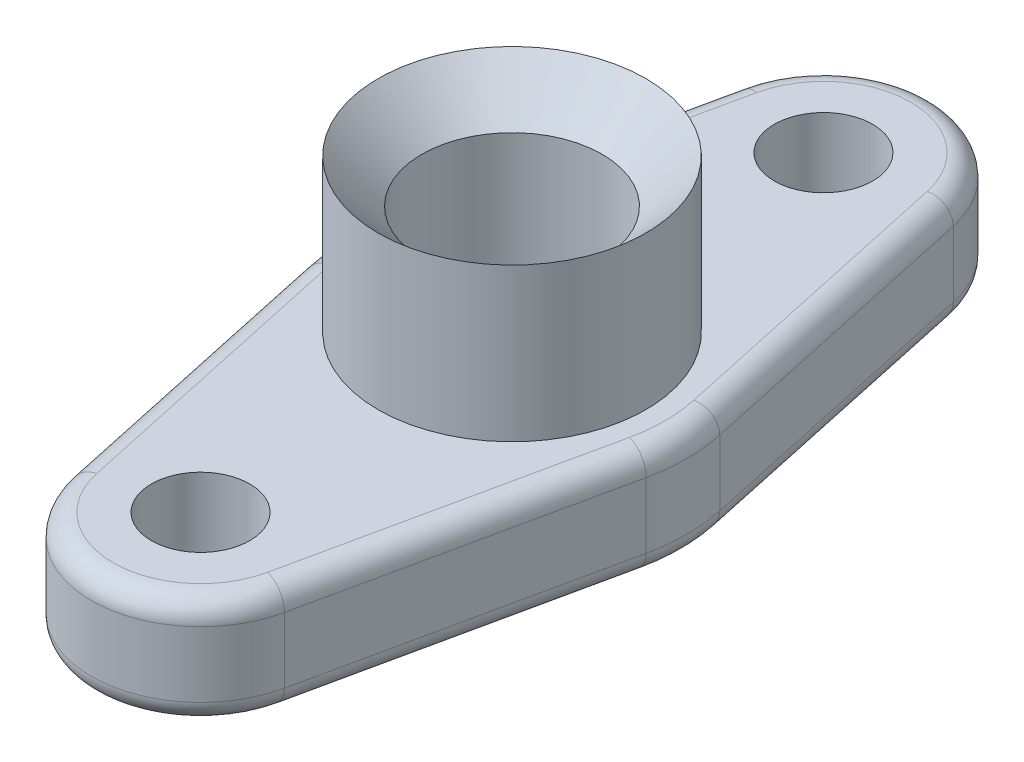
ISO-10303-21;
HEADER;
FILE_DESCRIPTION(('STEP AP214'),'2;1');
FILE_NAME('part.step','',(''),(''),'','','');
FILE_SCHEMA(('AUTOMOTIVE_DESIGN { 1 0 10303 214 1 1 1 1 }'));
ENDSEC;
DATA;
#1=APPLICATION_CONTEXT('core data for automotive mechanical design processes');
#2=APPLICATION_PROTOCOL_DEFINITION('international standard','automotive_design',2000,#1);
#3=PRODUCT_CONTEXT('',#1,'mechanical');
#4=PRODUCT('Part','Part','',(#3));
#5=PRODUCT_RELATED_PRODUCT_CATEGORY('part','',(#4));
#6=PRODUCT_DEFINITION_FORMATION('','',#4);
#7=PRODUCT_DEFINITION_CONTEXT('part definition',#1,'design');
#8=PRODUCT_DEFINITION('design','',#6,#7);
#9=PRODUCT_DEFINITION_SHAPE('','',#8);
#10=(LENGTH_UNIT() NAMED_UNIT(*) SI_UNIT(.MILLI.,.METRE.));
#11=(NAMED_UNIT(*) PLANE_ANGLE_UNIT() SI_UNIT($,.RADIAN.));
#12=(NAMED_UNIT(*) SI_UNIT($,.STERADIAN.) SOLID_ANGLE_UNIT());
#13=UNCERTAINTY_MEASURE_WITH_UNIT(LENGTH_MEASURE(1.E-05),#10,'distance_accuracy_value','');
#14=(GEOMETRIC_REPRESENTATION_CONTEXT(3) GLOBAL_UNCERTAINTY_ASSIGNED_CONTEXT((#13)) GLOBAL_UNIT_ASSIGNED_CONTEXT((#10,
#11,#12)) REPRESENTATION_CONTEXT('',''));
#15=CARTESIAN_POINT('',(0.,0.,0.));
#16=DIRECTION('',(0.,0.,1.));
#17=DIRECTION('',(1.,0.,0.));
#18=AXIS2_PLACEMENT_3D('',#15,#16,#17);
#19=CARTESIAN_POINT('',(0.,15.875,45.24375));
#20=DIRECTION('',(0.,-1.,0.));
#21=DIRECTION('',(0.,0.,-1.));
#22=AXIS2_PLACEMENT_3D('',#19,#20,#21);
#23=CYLINDRICAL_SURFACE('',#22,15.875);
#24=DIRECTION('',(0.,-1.,0.));
#25=VECTOR('',#24,1.);
#26=CARTESIAN_POINT('',(15.5192125254464,15.875,48.5858552631579));
#27=LINE('',#26,#25);
#28=CARTESIAN_POINT('',(15.5192125254464,12.7,48.5858552631579));
#29=VERTEX_POINT('',#28);
#30=CARTESIAN_POINT('',(15.5192125254464,3.175,48.5858552631579));
#31=VERTEX_POINT('',#30);
#32=EDGE_CURVE('E179',#29,#31,#27,.T.);
#33=ORIENTED_EDGE('',*,*,#32,.F.);
#34=CARTESIAN_POINT('',(0.,12.7,45.24375));
#35=DIRECTION('',(0.,1.,0.));
#36=DIRECTION('',(0.,0.,1.));
#37=AXIS2_PLACEMENT_3D('',#34,#35,#36);
#38=CIRCLE('',#37,15.875);
#39=CARTESIAN_POINT('',(-15.5192125254464,12.7,48.5858552631579));
#40=VERTEX_POINT('',#39);
#41=EDGE_CURVE('E242',#29,#40,#38,.F.);
#42=ORIENTED_EDGE('',*,*,#41,.T.);
#43=DIRECTION('',(0.,-1.,0.));
#44=VECTOR('',#43,1.);
#45=CARTESIAN_POINT('',(-15.5192125254464,15.875,48.5858552631579));
#46=LINE('',#45,#44);
#47=CARTESIAN_POINT('',(-15.5192125254464,3.175,48.5858552631579));
#48=VERTEX_POINT('',#47);
#49=EDGE_CURVE('E351',#40,#48,#46,.T.);
#50=ORIENTED_EDGE('',*,*,#49,.T.);
#51=CARTESIAN_POINT('',(0.,3.175,45.24375));
#52=DIRECTION('',(0.,1.,0.));
#53=DIRECTION('',(0.,0.,1.));
#54=AXIS2_PLACEMENT_3D('',#51,#52,#53);
#55=CIRCLE('',#54,15.875);
#56=EDGE_CURVE('E239',#48,#31,#55,.T.);
#57=ORIENTED_EDGE('',*,*,#56,.T.);
#58=EDGE_LOOP('',(#33,#42,#50,#57));
#59=FACE_BOUND('',#58,.T.);
#60=ADVANCED_FACE('F37',(#59),#23,.T.);
#61=CARTESIAN_POINT('',(24.8307400407142,15.875,5.34736842105263));
#62=DIRECTION('',(-0.9775881905793,0.,-0.210526315789474));
#63=DIRECTION('',(-0.210526315789474,0.,0.977588190579301));
#64=AXIS2_PLACEMENT_3D('',#61,#62,#63);
#65=PLANE('',#64);
#66=DIRECTION('',(0.,-1.,0.));
#67=VECTOR('',#66,1.);
#68=CARTESIAN_POINT('',(24.8307400407142,15.875,5.34736842105263));
#69=LINE('',#68,#67);
#70=CARTESIAN_POINT('',(24.8307400407142,12.7,5.34736842105263));
#71=VERTEX_POINT('',#70);
#72=CARTESIAN_POINT('',(24.8307400407142,3.175,5.34736842105263));
#73=VERTEX_POINT('',#72);
#74=EDGE_CURVE('E316',#71,#73,#69,.T.);
#75=ORIENTED_EDGE('',*,*,#74,.F.);
#76=DIRECTION('',(0.210526315789474,0.,-0.977588190579301));
#77=VECTOR('',#76,1.);
#78=CARTESIAN_POINT('',(15.5192125254464,12.7,48.5858552631579));
#79=LINE('',#78,#77);
#80=EDGE_CURVE('E245',#71,#29,#79,.F.);
#81=ORIENTED_EDGE('',*,*,#80,.T.);
#82=ORIENTED_EDGE('',*,*,#32,.T.);
#83=DIRECTION('',(0.210526315789474,0.,-0.977588190579301));
#84=VECTOR('',#83,1.);
#85=CARTESIAN_POINT('',(24.8307400407142,3.175,5.34736842105263));
#86=LINE('',#85,#84);
#87=EDGE_CURVE('E54',#31,#73,#86,.T.);
#88=ORIENTED_EDGE('',*,*,#87,.T.);
#89=EDGE_LOOP('',(#75,#81,#82,#88));
#90=FACE_BOUND('',#89,.T.);
#91=ADVANCED_FACE('F318',(#90),#65,.F.);
#92=CARTESIAN_POINT('',(0.,15.875,0.));
#93=DIRECTION('',(0.,-1.,0.));
#94=DIRECTION('',(0.,0.,-1.));
#95=AXIS2_PLACEMENT_3D('',#92,#93,#94);
#96=CYLINDRICAL_SURFACE('',#95,25.4);
#97=ORIENTED_EDGE('',*,*,#74,.T.);
#98=CARTESIAN_POINT('',(0.,3.175,0.));
#99=DIRECTION('',(0.,1.,0.));
#100=DIRECTION('',(0.,0.,1.));
#101=AXIS2_PLACEMENT_3D('',#98,#99,#100);
#102=CIRCLE('',#101,25.4);
#103=CARTESIAN_POINT('',(24.8307400407142,3.175,-5.34736842105263));
#104=VERTEX_POINT('',#103);
#105=EDGE_CURVE('E12',#73,#104,#102,.T.);
#106=ORIENTED_EDGE('',*,*,#105,.T.);
#107=DIRECTION('',(0.,-1.,0.));
#108=VECTOR('',#107,1.);
#109=CARTESIAN_POINT('',(24.8307400407142,15.875,-5.34736842105263));
#110=LINE('',#109,#108);
#111=CARTESIAN_POINT('',(24.8307400407142,12.7,-5.34736842105263));
#112=VERTEX_POINT('',#111);
#113=EDGE_CURVE('E309',#112,#104,#110,.T.);
#114=ORIENTED_EDGE('',*,*,#113,.F.);
#115=CARTESIAN_POINT('',(0.,12.7,0.));
#116=DIRECTION('',(0.,1.,0.));
#117=DIRECTION('',(0.,0.,1.));
#118=AXIS2_PLACEMENT_3D('',#115,#116,#117);
#119=CIRCLE('',#118,25.4);
#120=EDGE_CURVE('E46',#112,#71,#119,.F.);
#121=ORIENTED_EDGE('',*,*,#120,.T.);
#122=EDGE_LOOP('',(#97,#106,#114,#121));
#123=FACE_BOUND('',#122,.T.);
#124=ADVANCED_FACE('F405',(#123),#96,.T.);
#125=CARTESIAN_POINT('',(24.8307400407142,15.875,-5.34736842105263));
#126=DIRECTION('',(0.9775881905793,0.,-0.210526315789474));
#127=DIRECTION('',(-0.210526315789474,0.,-0.977588190579301));
#128=AXIS2_PLACEMENT_3D('',#125,#126,#127);
#129=PLANE('',#128);
#130=DIRECTION('',(0.,-1.,0.));
#131=VECTOR('',#130,1.);
#132=CARTESIAN_POINT('',(15.5192125254464,15.875,-48.5858552631579));
#133=LINE('',#132,#131);
#134=CARTESIAN_POINT('',(15.5192125254464,12.7,-48.5858552631579));
#135=VERTEX_POINT('',#134);
#136=CARTESIAN_POINT('',(15.5192125254464,3.175,-48.5858552631579));
#137=VERTEX_POINT('',#136);
#138=EDGE_CURVE('E301',#135,#137,#133,.T.);
#139=ORIENTED_EDGE('',*,*,#138,.F.);
#140=DIRECTION('',(0.210526315789474,0.,0.977588190579301));
#141=VECTOR('',#140,1.);
#142=CARTESIAN_POINT('',(24.8307400407142,12.7,-5.34736842105263));
#143=LINE('',#142,#141);
#144=EDGE_CURVE('E203',#135,#112,#143,.T.);
#145=ORIENTED_EDGE('',*,*,#144,.T.);
#146=ORIENTED_EDGE('',*,*,#113,.T.);
#147=DIRECTION('',(0.210526315789474,0.,0.977588190579301));
#148=VECTOR('',#147,1.);
#149=CARTESIAN_POINT('',(15.5192125254464,3.175,-48.5858552631579));
#150=LINE('',#149,#148);
#151=EDGE_CURVE('E201',#104,#137,#150,.F.);
#152=ORIENTED_EDGE('',*,*,#151,.T.);
#153=EDGE_LOOP('',(#139,#145,#146,#152));
#154=FACE_BOUND('',#153,.T.);
#155=ADVANCED_FACE('F611',(#154),#129,.T.);
#156=CARTESIAN_POINT('',(0.,15.875,-45.24375));
#157=DIRECTION('',(0.,-1.,0.));
#158=DIRECTION('',(0.,0.,-1.));
#159=AXIS2_PLACEMENT_3D('',#156,#157,#158);
#160=CYLINDRICAL_SURFACE('',#159,15.875);
#161=DIRECTION('',(0.,-1.,0.));
#162=VECTOR('',#161,1.);
#163=CARTESIAN_POINT('',(-15.5192125254464,15.875,-48.5858552631579));
#164=LINE('',#163,#162);
#165=CARTESIAN_POINT('',(-15.5192125254464,12.7,-48.5858552631579));
#166=VERTEX_POINT('',#165);
#167=CARTESIAN_POINT('',(-15.5192125254464,3.175,-48.5858552631579));
#168=VERTEX_POINT('',#167);
#169=EDGE_CURVE('E298',#166,#168,#164,.T.);
#170=ORIENTED_EDGE('',*,*,#169,.F.);
#171=CARTESIAN_POINT('',(0.,12.7,-45.24375));
#172=DIRECTION('',(0.,1.,0.));
#173=DIRECTION('',(0.,0.,1.));
#174=AXIS2_PLACEMENT_3D('',#171,#172,#173);
#175=CIRCLE('',#174,15.875);
#176=EDGE_CURVE('E225',#166,#135,#175,.F.);
#177=ORIENTED_EDGE('',*,*,#176,.T.);
#178=ORIENTED_EDGE('',*,*,#138,.T.);
#179=CARTESIAN_POINT('',(0.,3.175,-45.24375));
#180=DIRECTION('',(0.,1.,0.));
#181=DIRECTION('',(0.,0.,1.));
#182=AXIS2_PLACEMENT_3D('',#179,#180,#181);
#183=CIRCLE('',#182,15.875);
#184=EDGE_CURVE('E223',#137,#168,#183,.T.);
#185=ORIENTED_EDGE('',*,*,#184,.T.);
#186=EDGE_LOOP('',(#170,#177,#178,#185));
#187=FACE_BOUND('',#186,.T.);
#188=ADVANCED_FACE('F297',(#187),#160,.T.);
#189=CARTESIAN_POINT('',(-24.8307400407142,15.875,-5.34736842105263));
#190=DIRECTION('',(0.9775881905793,0.,0.210526315789474));
#191=DIRECTION('',(0.210526315789474,0.,-0.977588190579301));
#192=AXIS2_PLACEMENT_3D('',#189,#190,#191);
#193=PLANE('',#192);
#194=DIRECTION('',(0.,-1.,0.));
#195=VECTOR('',#194,1.);
#196=CARTESIAN_POINT('',(-24.8307400407142,15.875,-5.34736842105263));
#197=LINE('',#196,#195);
#198=CARTESIAN_POINT('',(-24.8307400407142,12.7,-5.34736842105263));
#199=VERTEX_POINT('',#198);
#200=CARTESIAN_POINT('',(-24.8307400407142,3.175,-5.34736842105263));
#201=VERTEX_POINT('',#200);
#202=EDGE_CURVE('E307',#199,#201,#197,.T.);
#203=ORIENTED_EDGE('',*,*,#202,.F.);
#204=DIRECTION('',(-0.210526315789474,0.,0.977588190579301));
#205=VECTOR('',#204,1.);
#206=CARTESIAN_POINT('',(-15.5192125254464,12.7,-48.5858552631579));
#207=LINE('',#206,#205);
#208=EDGE_CURVE('E229',#199,#166,#207,.F.);
#209=ORIENTED_EDGE('',*,*,#208,.T.);
#210=ORIENTED_EDGE('',*,*,#169,.T.);
#211=DIRECTION('',(-0.210526315789474,0.,0.977588190579301));
#212=VECTOR('',#211,1.);
#213=CARTESIAN_POINT('',(-24.8307400407142,3.175,-5.34736842105263));
#214=LINE('',#213,#212);
#215=EDGE_CURVE('E227',#168,#201,#214,.T.);
#216=ORIENTED_EDGE('',*,*,#215,.T.);
#217=EDGE_LOOP('',(#203,#209,#210,#216));
#218=FACE_BOUND('',#217,.T.);
#219=ADVANCED_FACE('F304',(#218),#193,.F.);
#220=CARTESIAN_POINT('',(0.,15.875,0.));
#221=DIRECTION('',(0.,-1.,0.));
#222=DIRECTION('',(0.,0.,-1.));
#223=AXIS2_PLACEMENT_3D('',#220,#221,#222);
#224=CYLINDRICAL_SURFACE('',#223,25.4);
#225=DIRECTION('',(0.,-1.,0.));
#226=VECTOR('',#225,1.);
#227=CARTESIAN_POINT('',(-24.8307400407142,15.875,5.34736842105263));
#228=LINE('',#227,#226);
#229=CARTESIAN_POINT('',(-24.8307400407142,12.7,5.34736842105263));
#230=VERTEX_POINT('',#229);
#231=CARTESIAN_POINT('',(-24.8307400407142,3.175,5.34736842105263));
#232=VERTEX_POINT('',#231);
#233=EDGE_CURVE('E311',#230,#232,#228,.T.);
#234=ORIENTED_EDGE('',*,*,#233,.F.);
#235=CARTESIAN_POINT('',(0.,12.7,0.));
#236=DIRECTION('',(0.,1.,0.));
#237=DIRECTION('',(0.,0.,1.));
#238=AXIS2_PLACEMENT_3D('',#235,#236,#237);
#239=CIRCLE('',#238,25.4);
#240=EDGE_CURVE('E233',#230,#199,#239,.F.);
#241=ORIENTED_EDGE('',*,*,#240,.T.);
#242=ORIENTED_EDGE('',*,*,#202,.T.);
#243=CARTESIAN_POINT('',(0.,3.175,0.));
#244=DIRECTION('',(0.,1.,0.));
#245=DIRECTION('',(0.,0.,1.));
#246=AXIS2_PLACEMENT_3D('',#243,#244,#245);
#247=CIRCLE('',#246,25.4);
#248=EDGE_CURVE('E231',#201,#232,#247,.T.);
#249=ORIENTED_EDGE('',*,*,#248,.T.);
#250=EDGE_LOOP('',(#234,#241,#242,#249));
#251=FACE_BOUND('',#250,.T.);
#252=ADVANCED_FACE('F353',(#251),#224,.T.);
#253=CARTESIAN_POINT('',(0.,15.875,45.24375));
#254=DIRECTION('',(0.,-1.,0.));
#255=DIRECTION('',(0.,0.,-1.));
#256=AXIS2_PLACEMENT_3D('',#253,#254,#255);
#257=CYLINDRICAL_SURFACE('',#256,7.14375);
#258=CARTESIAN_POINT('',(0.,15.875,45.24375));
#259=DIRECTION('',(0.,1.,0.));
#260=DIRECTION('',(0.,0.,1.));
#261=AXIS2_PLACEMENT_3D('',#258,#259,#260);
#262=CIRCLE('',#261,7.14375);
#263=CARTESIAN_POINT('',(0.,15.875,52.3875));
#264=VERTEX_POINT('',#263);
#265=EDGE_CURVE('E361',#264,#264,#262,.F.);
#266=ORIENTED_EDGE('',*,*,#265,.F.);
#267=EDGE_LOOP('',(#266));
#268=FACE_BOUND('',#267,.T.);
#269=CARTESIAN_POINT('',(0.,0.,45.24375));
#270=DIRECTION('',(0.,1.,0.));
#271=DIRECTION('',(0.,0.,1.));
#272=AXIS2_PLACEMENT_3D('',#269,#270,#271);
#273=CIRCLE('',#272,7.14375);
#274=CARTESIAN_POINT('',(0.,0.,52.3875));
#275=VERTEX_POINT('',#274);
#276=EDGE_CURVE('E362',#275,#275,#273,.F.);
#277=ORIENTED_EDGE('',*,*,#276,.T.);
#278=EDGE_LOOP('',(#277));
#279=FACE_BOUND('',#278,.T.);
#280=ADVANCED_FACE('F545',(#268,#279),#257,.F.);
#281=CARTESIAN_POINT('',(-24.8307400407142,15.875,5.34736842105263));
#282=DIRECTION('',(-0.9775881905793,0.,0.210526315789474));
#283=DIRECTION('',(0.210526315789474,0.,0.977588190579301));
#284=AXIS2_PLACEMENT_3D('',#281,#282,#283);
#285=PLANE('',#284);
#286=ORIENTED_EDGE('',*,*,#49,.F.);
#287=DIRECTION('',(-0.210526315789474,0.,-0.977588190579301));
#288=VECTOR('',#287,1.);
#289=CARTESIAN_POINT('',(-24.8307400407142,12.7,5.34736842105263));
#290=LINE('',#289,#288);
#291=EDGE_CURVE('E237',#40,#230,#290,.T.);
#292=ORIENTED_EDGE('',*,*,#291,.T.);
#293=ORIENTED_EDGE('',*,*,#233,.T.);
#294=DIRECTION('',(-0.210526315789474,0.,-0.977588190579301));
#295=VECTOR('',#294,1.);
#296=CARTESIAN_POINT('',(-15.5192125254464,3.175,48.5858552631579));
#297=LINE('',#296,#295);
#298=EDGE_CURVE('E235',#232,#48,#297,.F.);
#299=ORIENTED_EDGE('',*,*,#298,.T.);
#300=EDGE_LOOP('',(#286,#292,#293,#299));
#301=FACE_BOUND('',#300,.T.);
#302=ADVANCED_FACE('F349',(#301),#285,.T.);
#303=CARTESIAN_POINT('',(0.,15.875,-45.24375));
#304=DIRECTION('',(0.,-1.,0.));
#305=DIRECTION('',(0.,0.,-1.));
#306=AXIS2_PLACEMENT_3D('',#303,#304,#305);
#307=CYLINDRICAL_SURFACE('',#306,7.14375);
#308=CARTESIAN_POINT('',(0.,15.875,-45.24375));
#309=DIRECTION('',(0.,1.,0.));
#310=DIRECTION('',(0.,0.,1.));
#311=AXIS2_PLACEMENT_3D('',#308,#309,#310);
#312=CIRCLE('',#311,7.14375);
#313=CARTESIAN_POINT('',(0.,15.875,-38.1));
#314=VERTEX_POINT('',#313);
#315=EDGE_CURVE('E355',#314,#314,#312,.T.);
#316=ORIENTED_EDGE('',*,*,#315,.T.);
#317=EDGE_LOOP('',(#316));
#318=FACE_BOUND('',#317,.T.);
#319=CARTESIAN_POINT('',(0.,0.,-45.24375));
#320=DIRECTION('',(0.,1.,0.));
#321=DIRECTION('',(0.,0.,1.));
#322=AXIS2_PLACEMENT_3D('',#319,#320,#321);
#323=CIRCLE('',#322,7.14375);
#324=CARTESIAN_POINT('',(0.,0.,-38.1));
#325=VERTEX_POINT('',#324);
#326=EDGE_CURVE('E358',#325,#325,#323,.T.);
#327=ORIENTED_EDGE('',*,*,#326,.F.);
#328=EDGE_LOOP('',(#327));
#329=FACE_BOUND('',#328,.T.);
#330=ADVANCED_FACE('F532',(#318,#329),#307,.F.);
#331=CARTESIAN_POINT('',(0.,15.875,0.));
#332=DIRECTION('',(0.,1.,0.));
#333=DIRECTION('',(0.,0.,1.));
#334=AXIS2_PLACEMENT_3D('',#331,#332,#333);
#335=PLANE('',#334);
#336=CARTESIAN_POINT('',(0.,15.875,0.));
#337=DIRECTION('',(0.,1.,0.));
#338=DIRECTION('',(0.,0.,1.));
#339=AXIS2_PLACEMENT_3D('',#336,#337,#338);
#340=CIRCLE('',#339,22.225);
#341=CARTESIAN_POINT('',(21.7268975356249,15.875,4.67894736842104));
#342=VERTEX_POINT('',#341);
#343=CARTESIAN_POINT('',(21.7268975356249,15.875,-4.67894736842104));
#344=VERTEX_POINT('',#343);
#345=EDGE_CURVE('E206',#342,#344,#340,.T.);
#346=ORIENTED_EDGE('',*,*,#345,.T.);
#347=DIRECTION('',(0.210526315789474,0.,0.977588190579301));
#348=VECTOR('',#347,1.);
#349=CARTESIAN_POINT('',(21.726897535625,15.875,-4.67894736842105));
#350=LINE('',#349,#348);
#351=CARTESIAN_POINT('',(12.4153700203571,15.875,-47.9174342105263));
#352=VERTEX_POINT('',#351);
#353=EDGE_CURVE('E220',#344,#352,#350,.F.);
#354=ORIENTED_EDGE('',*,*,#353,.T.);
#355=CARTESIAN_POINT('',(0.,15.875,-45.24375));
#356=DIRECTION('',(0.,1.,0.));
#357=DIRECTION('',(0.,0.,1.));
#358=AXIS2_PLACEMENT_3D('',#355,#356,#357);
#359=CIRCLE('',#358,12.7);
#360=CARTESIAN_POINT('',(-12.4153700203571,15.875,-47.9174342105263));
#361=VERTEX_POINT('',#360);
#362=EDGE_CURVE('E218',#352,#361,#359,.T.);
#363=ORIENTED_EDGE('',*,*,#362,.T.);
#364=DIRECTION('',(-0.210526315789474,0.,0.977588190579301));
#365=VECTOR('',#364,1.);
#366=CARTESIAN_POINT('',(-21.726897535625,15.875,-4.67894736842105));
#367=LINE('',#366,#365);
#368=CARTESIAN_POINT('',(-21.7268975356249,15.875,-4.67894736842104));
#369=VERTEX_POINT('',#368);
#370=EDGE_CURVE('E216',#361,#369,#367,.T.);
#371=ORIENTED_EDGE('',*,*,#370,.T.);
#372=CARTESIAN_POINT('',(0.,15.875,0.));
#373=DIRECTION('',(0.,1.,0.));
#374=DIRECTION('',(0.,0.,1.));
#375=AXIS2_PLACEMENT_3D('',#372,#373,#374);
#376=CIRCLE('',#375,22.225);
#377=CARTESIAN_POINT('',(-21.726897535625,15.875,4.67894736842105));
#378=VERTEX_POINT('',#377);
#379=EDGE_CURVE('E214',#369,#378,#376,.T.);
#380=ORIENTED_EDGE('',*,*,#379,.T.);
#381=DIRECTION('',(-0.210526315789474,0.,-0.977588190579301));
#382=VECTOR('',#381,1.);
#383=CARTESIAN_POINT('',(-21.726897535625,15.875,4.67894736842105));
#384=LINE('',#383,#382);
#385=CARTESIAN_POINT('',(-12.4153700203571,15.875,47.9174342105263));
#386=VERTEX_POINT('',#385);
#387=EDGE_CURVE('E212',#378,#386,#384,.F.);
#388=ORIENTED_EDGE('',*,*,#387,.T.);
#389=CARTESIAN_POINT('',(0.,15.875,45.24375));
#390=DIRECTION('',(0.,1.,0.));
#391=DIRECTION('',(0.,0.,1.));
#392=AXIS2_PLACEMENT_3D('',#389,#390,#391);
#393=CIRCLE('',#392,12.7);
#394=CARTESIAN_POINT('',(12.4153700203571,15.875,47.9174342105263));
#395=VERTEX_POINT('',#394);
#396=EDGE_CURVE('E210',#386,#395,#393,.T.);
#397=ORIENTED_EDGE('',*,*,#396,.T.);
#398=DIRECTION('',(0.210526315789474,0.,-0.977588190579301));
#399=VECTOR('',#398,1.);
#400=CARTESIAN_POINT('',(21.726897535625,15.875,4.67894736842105));
#401=LINE('',#400,#399);
#402=EDGE_CURVE('E208',#395,#342,#401,.T.);
#403=ORIENTED_EDGE('',*,*,#402,.T.);
#404=EDGE_LOOP('',(#346,#354,#363,#371,#380,#388,#397,#403));
#405=FACE_BOUND('',#404,.T.);
#406=CARTESIAN_POINT('',(0.,15.875,0.));
#407=DIRECTION('',(0.,1.,0.));
#408=DIRECTION('',(0.,0.,1.));
#409=AXIS2_PLACEMENT_3D('',#406,#407,#408);
#410=CIRCLE('',#409,19.446875);
#411=CARTESIAN_POINT('',(0.,15.875,19.446875));
#412=VERTEX_POINT('',#411);
#413=EDGE_CURVE('E176',#412,#412,#410,.T.);
#414=ORIENTED_EDGE('',*,*,#413,.F.);
#415=EDGE_LOOP('',(#414));
#416=FACE_BOUND('',#415,.T.);
#417=ORIENTED_EDGE('',*,*,#265,.T.);
#418=EDGE_LOOP('',(#417));
#419=FACE_BOUND('',#418,.T.);
#420=ORIENTED_EDGE('',*,*,#315,.F.);
#421=EDGE_LOOP('',(#420));
#422=FACE_BOUND('',#421,.T.);
#423=ADVANCED_FACE('F336',(#405,#416,#419,#422),#335,.T.);
#424=CARTESIAN_POINT('',(0.,0.,0.));
#425=DIRECTION('',(0.,1.,0.));
#426=DIRECTION('',(0.,0.,1.));
#427=AXIS2_PLACEMENT_3D('',#424,#425,#426);
#428=PLANE('',#427);
#429=CARTESIAN_POINT('',(0.,0.,0.));
#430=DIRECTION('',(0.,1.,0.));
#431=DIRECTION('',(0.,0.,1.));
#432=AXIS2_PLACEMENT_3D('',#429,#430,#431);
#433=CIRCLE('',#432,21.986875);
#434=CARTESIAN_POINT('',(0.,0.,21.986875));
#435=VERTEX_POINT('',#434);
#436=EDGE_CURVE('E195',#435,#435,#433,.T.);
#437=ORIENTED_EDGE('',*,*,#436,.T.);
#438=EDGE_LOOP('',(#437));
#439=FACE_BOUND('',#438,.T.);
#440=DIRECTION('',(0.210526315789474,0.,-0.977588190579301));
#441=VECTOR('',#440,1.);
#442=CARTESIAN_POINT('',(21.726897535625,0.,4.67894736842105));
#443=LINE('',#442,#441);
#444=CARTESIAN_POINT('',(21.726897535625,0.,4.67894736842105));
#445=VERTEX_POINT('',#444);
#446=CARTESIAN_POINT('',(12.4153700203571,0.,47.9174342105263));
#447=VERTEX_POINT('',#446);
#448=EDGE_CURVE('E157',#445,#447,#443,.F.);
#449=ORIENTED_EDGE('',*,*,#448,.T.);
#450=CARTESIAN_POINT('',(0.,0.,45.24375));
#451=DIRECTION('',(0.,1.,0.));
#452=DIRECTION('',(0.,0.,1.));
#453=AXIS2_PLACEMENT_3D('',#450,#451,#452);
#454=CIRCLE('',#453,12.7);
#455=CARTESIAN_POINT('',(-12.4153700203571,0.,47.9174342105263));
#456=VERTEX_POINT('',#455);
#457=EDGE_CURVE('E193',#447,#456,#454,.F.);
#458=ORIENTED_EDGE('',*,*,#457,.T.);
#459=DIRECTION('',(-0.210526315789474,0.,-0.977588190579301));
#460=VECTOR('',#459,1.);
#461=CARTESIAN_POINT('',(-21.726897535625,0.,4.67894736842105));
#462=LINE('',#461,#460);
#463=CARTESIAN_POINT('',(-21.7268975356249,0.,4.67894736842104));
#464=VERTEX_POINT('',#463);
#465=EDGE_CURVE('E191',#456,#464,#462,.T.);
#466=ORIENTED_EDGE('',*,*,#465,.T.);
#467=CARTESIAN_POINT('',(0.,0.,0.));
#468=DIRECTION('',(0.,1.,0.));
#469=DIRECTION('',(0.,0.,1.));
#470=AXIS2_PLACEMENT_3D('',#467,#468,#469);
#471=CIRCLE('',#470,22.225);
#472=CARTESIAN_POINT('',(-21.726897535625,0.,-4.67894736842105));
#473=VERTEX_POINT('',#472);
#474=EDGE_CURVE('E189',#464,#473,#471,.F.);
#475=ORIENTED_EDGE('',*,*,#474,.T.);
#476=DIRECTION('',(-0.210526315789474,0.,0.977588190579301));
#477=VECTOR('',#476,1.);
#478=CARTESIAN_POINT('',(-21.726897535625,0.,-4.67894736842105));
#479=LINE('',#478,#477);
#480=CARTESIAN_POINT('',(-12.4153700203571,0.,-47.9174342105263));
#481=VERTEX_POINT('',#480);
#482=EDGE_CURVE('E187',#473,#481,#479,.F.);
#483=ORIENTED_EDGE('',*,*,#482,.T.);
#484=CARTESIAN_POINT('',(0.,0.,-45.24375));
#485=DIRECTION('',(0.,1.,0.));
#486=DIRECTION('',(0.,0.,1.));
#487=AXIS2_PLACEMENT_3D('',#484,#485,#486);
#488=CIRCLE('',#487,12.7);
#489=CARTESIAN_POINT('',(12.4153700203571,0.,-47.9174342105263));
#490=VERTEX_POINT('',#489);
#491=EDGE_CURVE('E185',#481,#490,#488,.F.);
#492=ORIENTED_EDGE('',*,*,#491,.T.);
#493=DIRECTION('',(0.210526315789474,0.,0.977588190579301));
#494=VECTOR('',#493,1.);
#495=CARTESIAN_POINT('',(21.726897535625,0.,-4.67894736842105));
#496=LINE('',#495,#494);
#497=CARTESIAN_POINT('',(21.7268975356249,0.,-4.67894736842104));
#498=VERTEX_POINT('',#497);
#499=EDGE_CURVE('E160',#490,#498,#496,.T.);
#500=ORIENTED_EDGE('',*,*,#499,.T.);
#501=CARTESIAN_POINT('',(0.,0.,0.));
#502=DIRECTION('',(0.,1.,0.));
#503=DIRECTION('',(0.,0.,1.));
#504=AXIS2_PLACEMENT_3D('',#501,#502,#503);
#505=CIRCLE('',#504,22.225);
#506=EDGE_CURVE('E151',#498,#445,#505,.F.);
#507=ORIENTED_EDGE('',*,*,#506,.T.);
#508=EDGE_LOOP('',(#449,#458,#466,#475,#483,#492,#500,#507));
#509=FACE_BOUND('',#508,.T.);
#510=ORIENTED_EDGE('',*,*,#276,.F.);
#511=EDGE_LOOP('',(#510));
#512=FACE_BOUND('',#511,.T.);
#513=ORIENTED_EDGE('',*,*,#326,.T.);
#514=EDGE_LOOP('',(#513));
#515=FACE_BOUND('',#514,.T.);
#516=ADVANCED_FACE('F153',(#439,#509,#512,#515),#428,.F.);
#517=CARTESIAN_POINT('',(19.446875,-3.175,0.));
#518=DIRECTION('',(0.,-1.,0.));
#519=DIRECTION('',(0.,0.,-1.));
#520=AXIS2_PLACEMENT_3D('',#517,#518,#519);
#521=PLANE('',#520);
#522=CARTESIAN_POINT('',(0.,-3.175,0.));
#523=DIRECTION('',(0.,-1.,0.));
#524=DIRECTION('',(0.,0.,-1.));
#525=AXIS2_PLACEMENT_3D('',#522,#523,#524);
#526=CIRCLE('',#525,19.446875);
#527=CARTESIAN_POINT('',(0.,-3.175,-19.446875));
#528=VERTEX_POINT('',#527);
#529=EDGE_CURVE('E372',#528,#528,#526,.T.);
#530=ORIENTED_EDGE('',*,*,#529,.T.);
#531=EDGE_LOOP('',(#530));
#532=FACE_BOUND('',#531,.T.);
#533=CARTESIAN_POINT('',(0.,-3.175,0.));
#534=DIRECTION('',(0.,-1.,0.));
#535=DIRECTION('',(0.,0.,-1.));
#536=AXIS2_PLACEMENT_3D('',#533,#534,#535);
#537=CIRCLE('',#536,13.096875);
#538=CARTESIAN_POINT('',(0.,-3.175,-13.096875));
#539=VERTEX_POINT('',#538);
#540=EDGE_CURVE('E365',#539,#539,#537,.T.);
#541=ORIENTED_EDGE('',*,*,#540,.F.);
#542=EDGE_LOOP('',(#541));
#543=FACE_BOUND('',#542,.T.);
#544=ADVANCED_FACE('F396',(#532,#543),#521,.T.);
#545=CARTESIAN_POINT('',(0.,-3.175,0.));
#546=DIRECTION('',(0.,-1.,0.));
#547=DIRECTION('',(0.,0.,-1.));
#548=AXIS2_PLACEMENT_3D('',#545,#546,#547);
#549=CYLINDRICAL_SURFACE('',#548,19.446875);
#550=CARTESIAN_POINT('',(0.,-2.54,0.));
#551=DIRECTION('',(0.,1.,0.));
#552=DIRECTION('',(0.,0.,1.));
#553=AXIS2_PLACEMENT_3D('',#550,#551,#552);
#554=CIRCLE('',#553,19.446875);
#555=CARTESIAN_POINT('',(0.,-2.54,19.446875));
#556=VERTEX_POINT('',#555);
#557=EDGE_CURVE('E198',#556,#556,#554,.F.);
#558=ORIENTED_EDGE('',*,*,#557,.T.);
#559=EDGE_LOOP('',(#558));
#560=FACE_BOUND('',#559,.T.);
#561=ORIENTED_EDGE('',*,*,#529,.F.);
#562=EDGE_LOOP('',(#561));
#563=FACE_BOUND('',#562,.T.);
#564=ADVANCED_FACE('F387',(#560,#563),#549,.T.);
#565=CARTESIAN_POINT('',(0.,15.875,0.));
#566=DIRECTION('',(0.,-1.,0.));
#567=DIRECTION('',(0.,0.,-1.));
#568=AXIS2_PLACEMENT_3D('',#565,#566,#567);
#569=CYLINDRICAL_SURFACE('',#568,13.096875);
#570=ORIENTED_EDGE('',*,*,#540,.T.);
#571=EDGE_LOOP('',(#570));
#572=FACE_BOUND('',#571,.T.);
#573=CARTESIAN_POINT('',(0.,31.7500000000001,0.));
#574=DIRECTION('',(0.,-1.,0.));
#575=DIRECTION('',(0.,0.,-1.));
#576=AXIS2_PLACEMENT_3D('',#573,#574,#575);
#577=CIRCLE('',#576,13.096875);
#578=CARTESIAN_POINT('',(0.,31.7500000000001,-13.096875));
#579=VERTEX_POINT('',#578);
#580=EDGE_CURVE('E270',#579,#579,#577,.T.);
#581=ORIENTED_EDGE('',*,*,#580,.F.);
#582=EDGE_LOOP('',(#581));
#583=FACE_BOUND('',#582,.T.);
#584=ADVANCED_FACE('F384',(#572,#583),#569,.F.);
#585=ORIENTED_EDGE('',*,*,#413,.T.);
#586=EDGE_LOOP('',(#585));
#587=FACE_BOUND('',#586,.T.);
#588=CARTESIAN_POINT('',(0.,38.1,0.));
#589=DIRECTION('',(0.,-1.,0.));
#590=DIRECTION('',(0.,0.,-1.));
#591=AXIS2_PLACEMENT_3D('',#588,#589,#590);
#592=CIRCLE('',#591,19.446875);
#593=CARTESIAN_POINT('',(0.,38.1,-19.446875));
#594=VERTEX_POINT('',#593);
#595=EDGE_CURVE('E375',#594,#594,#592,.T.);
#596=ORIENTED_EDGE('',*,*,#595,.T.);
#597=EDGE_LOOP('',(#596));
#598=FACE_BOUND('',#597,.T.);
#599=ADVANCED_FACE('F386',(#587,#598),#549,.T.);
#600=CARTESIAN_POINT('',(0.,38.1,0.));
#601=DIRECTION('',(0.,1.,0.));
#602=DIRECTION('',(0.,0.,1.));
#603=AXIS2_PLACEMENT_3D('',#600,#601,#602);
#604=CONICAL_SURFACE('',#603,19.446875,0.785398163397453);
#605=ORIENTED_EDGE('',*,*,#580,.T.);
#606=EDGE_LOOP('',(#605));
#607=FACE_BOUND('',#606,.T.);
#608=ORIENTED_EDGE('',*,*,#595,.F.);
#609=EDGE_LOOP('',(#608));
#610=FACE_BOUND('',#609,.T.);
#611=ADVANCED_FACE('F381',(#607,#610),#604,.F.);
#612=CARTESIAN_POINT('',(0.,-2.54,0.));
#613=DIRECTION('',(0.,1.,0.));
#614=DIRECTION('',(0.,0.,1.));
#615=AXIS2_PLACEMENT_3D('',#612,#613,#614);
#616=TOROIDAL_SURFACE('',#615,21.986875,2.54);
#617=ORIENTED_EDGE('',*,*,#557,.F.);
#618=EDGE_LOOP('',(#617));
#619=FACE_BOUND('',#618,.T.);
#620=ORIENTED_EDGE('',*,*,#436,.F.);
#621=EDGE_LOOP('',(#620));
#622=FACE_BOUND('',#621,.T.);
#623=ADVANCED_FACE('F409',(#619,#622),#616,.F.);
#624=CARTESIAN_POINT('',(-21.726897535625,12.7,4.67894736842105));
#625=DIRECTION('',(-0.210526315789474,0.,-0.977588190579301));
#626=DIRECTION('',(-0.977588190579301,0.,0.210526315789474));
#627=AXIS2_PLACEMENT_3D('',#624,#625,#626);
#628=CYLINDRICAL_SURFACE('',#627,3.175);
#629=CARTESIAN_POINT('',(-12.4153700203571,12.7,47.9174342105263));
#630=DIRECTION('',(0.210526315789475,0.,0.9775881905793));
#631=DIRECTION('',(0.9775881905793,0.,-0.210526315789475));
#632=AXIS2_PLACEMENT_3D('',#629,#630,#631);
#633=CIRCLE('',#632,3.175);
#634=EDGE_CURVE('E264',#386,#40,#633,.T.);
#635=ORIENTED_EDGE('',*,*,#634,.F.);
#636=ORIENTED_EDGE('',*,*,#387,.F.);
#637=CARTESIAN_POINT('',(-21.726897535625,12.7,4.67894736842105));
#638=DIRECTION('',(-0.210526315789474,0.,-0.977588190579301));
#639=DIRECTION('',(-0.977588190579301,0.,0.210526315789474));
#640=AXIS2_PLACEMENT_3D('',#637,#638,#639);
#641=CIRCLE('',#640,3.175);
#642=EDGE_CURVE('E267',#230,#378,#641,.T.);
#643=ORIENTED_EDGE('',*,*,#642,.F.);
#644=ORIENTED_EDGE('',*,*,#291,.F.);
#645=EDGE_LOOP('',(#635,#636,#643,#644));
#646=FACE_BOUND('',#645,.T.);
#647=ADVANCED_FACE('F344',(#646),#628,.T.);
#648=CARTESIAN_POINT('',(0.,12.7,0.));
#649=DIRECTION('',(0.,1.,0.));
#650=DIRECTION('',(0.,0.,1.));
#651=AXIS2_PLACEMENT_3D('',#648,#649,#650);
#652=TOROIDAL_SURFACE('',#651,22.225,3.175);
#653=ORIENTED_EDGE('',*,*,#642,.T.);
#654=ORIENTED_EDGE('',*,*,#379,.F.);
#655=CARTESIAN_POINT('',(-21.726897535625,12.7,-4.67894736842105));
#656=DIRECTION('',(0.210526315789473,0.,-0.977588190579301));
#657=DIRECTION('',(-0.977588190579301,0.,-0.210526315789473));
#658=AXIS2_PLACEMENT_3D('',#655,#656,#657);
#659=CIRCLE('',#658,3.175);
#660=EDGE_CURVE('E261',#199,#369,#659,.T.);
#661=ORIENTED_EDGE('',*,*,#660,.F.);
#662=ORIENTED_EDGE('',*,*,#240,.F.);
#663=EDGE_LOOP('',(#653,#654,#661,#662));
#664=FACE_BOUND('',#663,.T.);
#665=ADVANCED_FACE('F433',(#664),#652,.T.);
#666=CARTESIAN_POINT('',(0.,12.7,45.24375));
#667=DIRECTION('',(0.,1.,0.));
#668=DIRECTION('',(0.,0.,1.));
#669=AXIS2_PLACEMENT_3D('',#666,#667,#668);
#670=TOROIDAL_SURFACE('',#669,12.7,3.175);
#671=ORIENTED_EDGE('',*,*,#634,.T.);
#672=ORIENTED_EDGE('',*,*,#41,.F.);
#673=CARTESIAN_POINT('',(12.4153700203571,12.7,47.9174342105263));
#674=DIRECTION('',(0.210526315789472,0.,-0.977588190579301));
#675=DIRECTION('',(-0.977588190579301,0.,-0.210526315789472));
#676=AXIS2_PLACEMENT_3D('',#673,#674,#675);
#677=CIRCLE('',#676,3.175);
#678=EDGE_CURVE('E258',#395,#29,#677,.T.);
#679=ORIENTED_EDGE('',*,*,#678,.F.);
#680=ORIENTED_EDGE('',*,*,#396,.F.);
#681=EDGE_LOOP('',(#671,#672,#679,#680));
#682=FACE_BOUND('',#681,.T.);
#683=ADVANCED_FACE('F327',(#682),#670,.T.);
#684=CARTESIAN_POINT('',(-21.726897535625,12.7,-4.67894736842105));
#685=DIRECTION('',(0.210526315789474,0.,-0.977588190579301));
#686=DIRECTION('',(-0.977588190579301,0.,-0.210526315789474));
#687=AXIS2_PLACEMENT_3D('',#684,#685,#686);
#688=CYLINDRICAL_SURFACE('',#687,3.175);
#689=ORIENTED_EDGE('',*,*,#660,.T.);
#690=ORIENTED_EDGE('',*,*,#370,.F.);
#691=CARTESIAN_POINT('',(-12.4153700203571,12.7,-47.9174342105263));
#692=DIRECTION('',(0.210526315789475,0.,-0.9775881905793));
#693=DIRECTION('',(-0.9775881905793,0.,-0.210526315789475));
#694=AXIS2_PLACEMENT_3D('',#691,#692,#693);
#695=CIRCLE('',#694,3.175);
#696=EDGE_CURVE('E255',#166,#361,#695,.T.);
#697=ORIENTED_EDGE('',*,*,#696,.F.);
#698=ORIENTED_EDGE('',*,*,#208,.F.);
#699=EDGE_LOOP('',(#689,#690,#697,#698));
#700=FACE_BOUND('',#699,.T.);
#701=ADVANCED_FACE('F427',(#700),#688,.T.);
#702=CARTESIAN_POINT('',(21.726897535625,12.7,4.67894736842105));
#703=DIRECTION('',(-0.210526315789474,0.,0.977588190579301));
#704=DIRECTION('',(0.977588190579301,0.,0.210526315789474));
#705=AXIS2_PLACEMENT_3D('',#702,#703,#704);
#706=CYLINDRICAL_SURFACE('',#705,3.175);
#707=ORIENTED_EDGE('',*,*,#678,.T.);
#708=ORIENTED_EDGE('',*,*,#80,.F.);
#709=CARTESIAN_POINT('',(21.726897535625,12.7,4.67894736842105));
#710=DIRECTION('',(0.210526315789474,0.,-0.977588190579301));
#711=DIRECTION('',(-0.977588190579301,0.,-0.210526315789474));
#712=AXIS2_PLACEMENT_3D('',#709,#710,#711);
#713=CIRCLE('',#712,3.175);
#714=EDGE_CURVE('E252',#342,#71,#713,.T.);
#715=ORIENTED_EDGE('',*,*,#714,.F.);
#716=ORIENTED_EDGE('',*,*,#402,.F.);
#717=EDGE_LOOP('',(#707,#708,#715,#716));
#718=FACE_BOUND('',#717,.T.);
#719=ADVANCED_FACE('F332',(#718),#706,.T.);
#720=CARTESIAN_POINT('',(0.,12.7,-45.24375));
#721=DIRECTION('',(0.,1.,0.));
#722=DIRECTION('',(0.,0.,1.));
#723=AXIS2_PLACEMENT_3D('',#720,#721,#722);
#724=TOROIDAL_SURFACE('',#723,12.7,3.175);
#725=ORIENTED_EDGE('',*,*,#696,.T.);
#726=ORIENTED_EDGE('',*,*,#362,.F.);
#727=CARTESIAN_POINT('',(12.4153700203571,12.7,-47.9174342105263));
#728=DIRECTION('',(0.210526315789472,0.,0.977588190579301));
#729=DIRECTION('',(0.977588190579301,0.,-0.210526315789472));
#730=AXIS2_PLACEMENT_3D('',#727,#728,#729);
#731=CIRCLE('',#730,3.175);
#732=EDGE_CURVE('E250',#135,#352,#731,.T.);
#733=ORIENTED_EDGE('',*,*,#732,.F.);
#734=ORIENTED_EDGE('',*,*,#176,.F.);
#735=EDGE_LOOP('',(#725,#726,#733,#734));
#736=FACE_BOUND('',#735,.T.);
#737=ADVANCED_FACE('F420',(#736),#724,.T.);
#738=CARTESIAN_POINT('',(0.,12.7,0.));
#739=DIRECTION('',(0.,1.,0.));
#740=DIRECTION('',(0.,0.,1.));
#741=AXIS2_PLACEMENT_3D('',#738,#739,#740);
#742=TOROIDAL_SURFACE('',#741,22.225,3.175);
#743=ORIENTED_EDGE('',*,*,#714,.T.);
#744=ORIENTED_EDGE('',*,*,#120,.F.);
#745=CARTESIAN_POINT('',(21.7268975356249,12.7,-4.67894736842104));
#746=DIRECTION('',(-0.210526315789474,0.,-0.977588190579301));
#747=DIRECTION('',(-0.977588190579301,0.,0.210526315789474));
#748=AXIS2_PLACEMENT_3D('',#745,#746,#747);
#749=CIRCLE('',#748,3.175);
#750=EDGE_CURVE('E248',#344,#112,#749,.T.);
#751=ORIENTED_EDGE('',*,*,#750,.F.);
#752=ORIENTED_EDGE('',*,*,#345,.F.);
#753=EDGE_LOOP('',(#743,#744,#751,#752));
#754=FACE_BOUND('',#753,.T.);
#755=ADVANCED_FACE('F416',(#754),#742,.T.);
#756=CARTESIAN_POINT('',(21.726897535625,12.7,-4.67894736842105));
#757=DIRECTION('',(0.210526315789474,0.,0.977588190579301));
#758=DIRECTION('',(0.977588190579301,0.,-0.210526315789474));
#759=AXIS2_PLACEMENT_3D('',#756,#757,#758);
#760=CYLINDRICAL_SURFACE('',#759,3.175);
#761=ORIENTED_EDGE('',*,*,#732,.T.);
#762=ORIENTED_EDGE('',*,*,#353,.F.);
#763=ORIENTED_EDGE('',*,*,#750,.T.);
#764=ORIENTED_EDGE('',*,*,#144,.F.);
#765=EDGE_LOOP('',(#761,#762,#763,#764));
#766=FACE_BOUND('',#765,.T.);
#767=ADVANCED_FACE('F413',(#766),#760,.T.);
#768=CARTESIAN_POINT('',(0.,3.175,-45.24375));
#769=DIRECTION('',(0.,1.,0.));
#770=DIRECTION('',(0.,0.,1.));
#771=AXIS2_PLACEMENT_3D('',#768,#769,#770);
#772=TOROIDAL_SURFACE('',#771,12.7,3.175);
#773=CARTESIAN_POINT('',(-12.4153700203571,3.175,-47.9174342105263));
#774=DIRECTION('',(-0.210526315789472,0.,0.977588190579301));
#775=DIRECTION('',(0.977588190579301,0.,0.210526315789472));
#776=AXIS2_PLACEMENT_3D('',#773,#774,#775);
#777=CIRCLE('',#776,3.175);
#778=EDGE_CURVE('E279',#168,#481,#777,.T.);
#779=ORIENTED_EDGE('',*,*,#778,.F.);
#780=ORIENTED_EDGE('',*,*,#184,.F.);
#781=CARTESIAN_POINT('',(12.4153700203571,3.175,-47.9174342105263));
#782=DIRECTION('',(0.210526315789472,0.,0.977588190579301));
#783=DIRECTION('',(0.977588190579301,0.,-0.210526315789472));
#784=AXIS2_PLACEMENT_3D('',#781,#782,#783);
#785=CIRCLE('',#784,3.175);
#786=EDGE_CURVE('E41',#490,#137,#785,.T.);
#787=ORIENTED_EDGE('',*,*,#786,.F.);
#788=ORIENTED_EDGE('',*,*,#491,.F.);
#789=EDGE_LOOP('',(#779,#780,#787,#788));
#790=FACE_BOUND('',#789,.T.);
#791=ADVANCED_FACE('F39',(#790),#772,.T.);
#792=CARTESIAN_POINT('',(21.726897535625,3.175,-4.67894736842105));
#793=DIRECTION('',(-0.210526315789474,0.,-0.977588190579301));
#794=DIRECTION('',(-0.977588190579301,0.,0.210526315789474));
#795=AXIS2_PLACEMENT_3D('',#792,#793,#794);
#796=CYLINDRICAL_SURFACE('',#795,3.175);
#797=ORIENTED_EDGE('',*,*,#786,.T.);
#798=ORIENTED_EDGE('',*,*,#151,.F.);
#799=CARTESIAN_POINT('',(21.726897535625,3.175,-4.67894736842105));
#800=DIRECTION('',(0.210526315789474,0.,0.977588190579301));
#801=DIRECTION('',(0.977588190579301,0.,-0.210526315789474));
#802=AXIS2_PLACEMENT_3D('',#799,#800,#801);
#803=CIRCLE('',#802,3.175);
#804=EDGE_CURVE('E278',#498,#104,#803,.T.);
#805=ORIENTED_EDGE('',*,*,#804,.F.);
#806=ORIENTED_EDGE('',*,*,#499,.F.);
#807=EDGE_LOOP('',(#797,#798,#805,#806));
#808=FACE_BOUND('',#807,.T.);
#809=ADVANCED_FACE('F289',(#808),#796,.T.);
#810=CARTESIAN_POINT('',(-21.726897535625,3.175,-4.67894736842105));
#811=DIRECTION('',(-0.210526315789474,0.,0.977588190579301));
#812=DIRECTION('',(0.977588190579301,0.,0.210526315789474));
#813=AXIS2_PLACEMENT_3D('',#810,#811,#812);
#814=CYLINDRICAL_SURFACE('',#813,3.175);
#815=ORIENTED_EDGE('',*,*,#778,.T.);
#816=ORIENTED_EDGE('',*,*,#482,.F.);
#817=CARTESIAN_POINT('',(-21.726897535625,3.175,-4.67894736842105));
#818=DIRECTION('',(-0.210526315789474,0.,0.977588190579301));
#819=DIRECTION('',(0.977588190579301,0.,0.210526315789474));
#820=AXIS2_PLACEMENT_3D('',#817,#818,#819);
#821=CIRCLE('',#820,3.175);
#822=EDGE_CURVE('E170',#201,#473,#821,.T.);
#823=ORIENTED_EDGE('',*,*,#822,.F.);
#824=ORIENTED_EDGE('',*,*,#215,.F.);
#825=EDGE_LOOP('',(#815,#816,#823,#824));
#826=FACE_BOUND('',#825,.T.);
#827=ADVANCED_FACE('F455',(#826),#814,.T.);
#828=CARTESIAN_POINT('',(0.,3.175,0.));
#829=DIRECTION('',(0.,1.,0.));
#830=DIRECTION('',(0.,0.,1.));
#831=AXIS2_PLACEMENT_3D('',#828,#829,#830);
#832=TOROIDAL_SURFACE('',#831,22.225,3.175);
#833=ORIENTED_EDGE('',*,*,#804,.T.);
#834=ORIENTED_EDGE('',*,*,#105,.F.);
#835=CARTESIAN_POINT('',(21.7268975356249,3.175,4.67894736842104));
#836=DIRECTION('',(-0.210526315789474,0.,0.9775881905793));
#837=DIRECTION('',(0.977588190579301,0.,0.210526315789474));
#838=AXIS2_PLACEMENT_3D('',#835,#836,#837);
#839=CIRCLE('',#838,3.175);
#840=EDGE_CURVE('E167',#445,#73,#839,.T.);
#841=ORIENTED_EDGE('',*,*,#840,.F.);
#842=ORIENTED_EDGE('',*,*,#506,.F.);
#843=EDGE_LOOP('',(#833,#834,#841,#842));
#844=FACE_BOUND('',#843,.T.);
#845=ADVANCED_FACE('F168',(#844),#832,.T.);
#846=CARTESIAN_POINT('',(0.,3.175,0.));
#847=DIRECTION('',(0.,1.,0.));
#848=DIRECTION('',(0.,0.,1.));
#849=AXIS2_PLACEMENT_3D('',#846,#847,#848);
#850=TOROIDAL_SURFACE('',#849,22.225,3.175);
#851=ORIENTED_EDGE('',*,*,#822,.T.);
#852=ORIENTED_EDGE('',*,*,#474,.F.);
#853=CARTESIAN_POINT('',(-21.726897535625,3.175,4.67894736842105));
#854=DIRECTION('',(0.210526315789473,0.,0.977588190579301));
#855=DIRECTION('',(0.977588190579301,0.,-0.210526315789473));
#856=AXIS2_PLACEMENT_3D('',#853,#854,#855);
#857=CIRCLE('',#856,3.175);
#858=EDGE_CURVE('E171',#232,#464,#857,.T.);
#859=ORIENTED_EDGE('',*,*,#858,.F.);
#860=ORIENTED_EDGE('',*,*,#248,.F.);
#861=EDGE_LOOP('',(#851,#852,#859,#860));
#862=FACE_BOUND('',#861,.T.);
#863=ADVANCED_FACE('F449',(#862),#850,.T.);
#864=CARTESIAN_POINT('',(21.726897535625,3.175,4.67894736842105));
#865=DIRECTION('',(0.210526315789474,0.,-0.977588190579301));
#866=DIRECTION('',(-0.977588190579301,0.,-0.210526315789474));
#867=AXIS2_PLACEMENT_3D('',#864,#865,#866);
#868=CYLINDRICAL_SURFACE('',#867,3.175);
#869=ORIENTED_EDGE('',*,*,#840,.T.);
#870=ORIENTED_EDGE('',*,*,#87,.F.);
#871=CARTESIAN_POINT('',(12.4153700203571,3.175,47.9174342105263));
#872=DIRECTION('',(-0.210526315789473,0.,0.977588190579301));
#873=DIRECTION('',(0.977588190579301,0.,0.210526315789473));
#874=AXIS2_PLACEMENT_3D('',#871,#872,#873);
#875=CIRCLE('',#874,3.175);
#876=EDGE_CURVE('E174',#447,#31,#875,.T.);
#877=ORIENTED_EDGE('',*,*,#876,.F.);
#878=ORIENTED_EDGE('',*,*,#448,.F.);
#879=EDGE_LOOP('',(#869,#870,#877,#878));
#880=FACE_BOUND('',#879,.T.);
#881=ADVANCED_FACE('F173',(#880),#868,.T.);
#882=CARTESIAN_POINT('',(-21.726897535625,3.175,4.67894736842105));
#883=DIRECTION('',(0.210526315789474,0.,0.977588190579301));
#884=DIRECTION('',(0.977588190579301,0.,-0.210526315789474));
#885=AXIS2_PLACEMENT_3D('',#882,#883,#884);
#886=CYLINDRICAL_SURFACE('',#885,3.175);
#887=ORIENTED_EDGE('',*,*,#858,.T.);
#888=ORIENTED_EDGE('',*,*,#465,.F.);
#889=CARTESIAN_POINT('',(-12.4153700203571,3.175,47.9174342105263));
#890=DIRECTION('',(0.210526315789475,0.,0.9775881905793));
#891=DIRECTION('',(0.9775881905793,0.,-0.210526315789475));
#892=AXIS2_PLACEMENT_3D('',#889,#890,#891);
#893=CIRCLE('',#892,3.175);
#894=EDGE_CURVE('E271',#48,#456,#893,.T.);
#895=ORIENTED_EDGE('',*,*,#894,.F.);
#896=ORIENTED_EDGE('',*,*,#298,.F.);
#897=EDGE_LOOP('',(#887,#888,#895,#896));
#898=FACE_BOUND('',#897,.T.);
#899=ADVANCED_FACE('F442',(#898),#886,.T.);
#900=CARTESIAN_POINT('',(0.,3.175,45.24375));
#901=DIRECTION('',(0.,1.,0.));
#902=DIRECTION('',(0.,0.,1.));
#903=AXIS2_PLACEMENT_3D('',#900,#901,#902);
#904=TOROIDAL_SURFACE('',#903,12.7,3.175);
#905=ORIENTED_EDGE('',*,*,#876,.T.);
#906=ORIENTED_EDGE('',*,*,#56,.F.);
#907=ORIENTED_EDGE('',*,*,#894,.T.);
#908=ORIENTED_EDGE('',*,*,#457,.F.);
#909=EDGE_LOOP('',(#905,#906,#907,#908));
#910=FACE_BOUND('',#909,.T.);
#911=ADVANCED_FACE('F439',(#910),#904,.T.);
#912=CLOSED_SHELL('',(#60,#91,#124,#155,#188,#219,#252,#280,#302,#330,#423,#516,#544,#564,#584,
#599,#611,#623,#647,#665,#683,#701,#719,#737,#755,#767,#791,#809,#827,#845,#863,#881,#899,#911));
#913=MANIFOLD_SOLID_BREP('B2',#912);
#914=ADVANCED_BREP_SHAPE_REPRESENTATION('',(#18,#913),#14);
#915=SHAPE_DEFINITION_REPRESENTATION(#9,#914);
ENDSEC;
END-ISO-10303-21;
